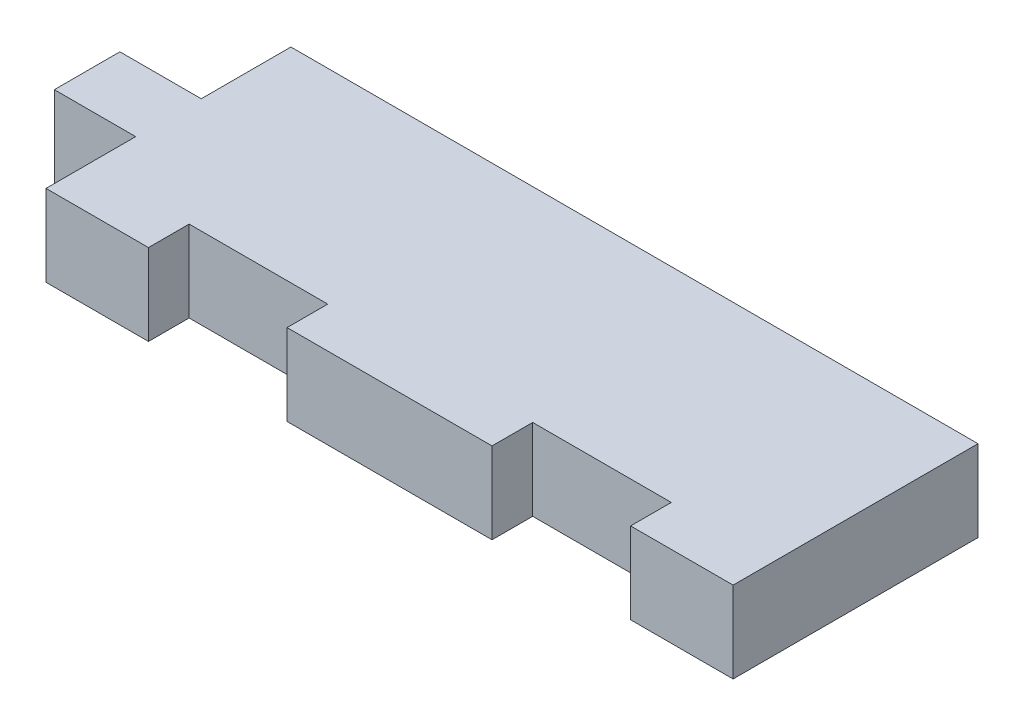
ISO-10303-21;
HEADER;
FILE_DESCRIPTION(('STEP AP214'),'2;1');
FILE_NAME('part.step','',(''),(''),'','','');
FILE_SCHEMA(('AUTOMOTIVE_DESIGN { 1 0 10303 214 1 1 1 1 }'));
ENDSEC;
DATA;
#1=APPLICATION_CONTEXT('core data for automotive mechanical design processes');
#2=APPLICATION_PROTOCOL_DEFINITION('international standard','automotive_design',2000,#1);
#3=PRODUCT_CONTEXT('',#1,'mechanical');
#4=PRODUCT('Part','Part','',(#3));
#5=PRODUCT_RELATED_PRODUCT_CATEGORY('part','',(#4));
#6=PRODUCT_DEFINITION_FORMATION('','',#4);
#7=PRODUCT_DEFINITION_CONTEXT('part definition',#1,'design');
#8=PRODUCT_DEFINITION('design','',#6,#7);
#9=PRODUCT_DEFINITION_SHAPE('','',#8);
#10=(LENGTH_UNIT() NAMED_UNIT(*) SI_UNIT(.MILLI.,.METRE.));
#11=(NAMED_UNIT(*) PLANE_ANGLE_UNIT() SI_UNIT($,.RADIAN.));
#12=(NAMED_UNIT(*) SI_UNIT($,.STERADIAN.) SOLID_ANGLE_UNIT());
#13=UNCERTAINTY_MEASURE_WITH_UNIT(LENGTH_MEASURE(1.E-05),#10,'distance_accuracy_value','');
#14=(GEOMETRIC_REPRESENTATION_CONTEXT(3) GLOBAL_UNCERTAINTY_ASSIGNED_CONTEXT((#13)) GLOBAL_UNIT_ASSIGNED_CONTEXT((#10,
#11,#12)) REPRESENTATION_CONTEXT('',''));
#15=CARTESIAN_POINT('',(0.,0.,0.));
#16=DIRECTION('',(0.,0.,1.));
#17=DIRECTION('',(1.,0.,0.));
#18=AXIS2_PLACEMENT_3D('',#15,#16,#17);
#19=CARTESIAN_POINT('',(26.8205963302752,6.35,9.55999999999996));
#20=DIRECTION('',(-1.,0.,0.));
#21=DIRECTION('',(0.,0.,1.));
#22=AXIS2_PLACEMENT_3D('',#19,#20,#21);
#23=PLANE('',#22);
#24=DIRECTION('',(0.,0.,-1.));
#25=VECTOR('',#24,1.);
#26=CARTESIAN_POINT('',(26.8205963302752,0.,9.55999999999996));
#27=LINE('',#26,#25);
#28=CARTESIAN_POINT('',(26.8205963302752,0.,9.55999999999996));
#29=VERTEX_POINT('',#28);
#30=CARTESIAN_POINT('',(26.8205963302752,0.,-9.56000000000004));
#31=VERTEX_POINT('',#30);
#32=EDGE_CURVE('E192',#29,#31,#27,.T.);
#33=ORIENTED_EDGE('',*,*,#32,.T.);
#34=DIRECTION('',(0.,-1.,0.));
#35=VECTOR('',#34,1.);
#36=CARTESIAN_POINT('',(26.8205963302752,6.35,-9.56000000000004));
#37=LINE('',#36,#35);
#38=CARTESIAN_POINT('',(26.8205963302752,6.35,-9.56000000000004));
#39=VERTEX_POINT('',#38);
#40=EDGE_CURVE('E11',#39,#31,#37,.T.);
#41=ORIENTED_EDGE('',*,*,#40,.F.);
#42=DIRECTION('',(0.,0.,-1.));
#43=VECTOR('',#42,1.);
#44=CARTESIAN_POINT('',(26.8205963302752,6.35,9.55999999999996));
#45=LINE('',#44,#43);
#46=CARTESIAN_POINT('',(26.8205963302752,6.35,9.55999999999996));
#47=VERTEX_POINT('',#46);
#48=EDGE_CURVE('E238',#47,#39,#45,.T.);
#49=ORIENTED_EDGE('',*,*,#48,.F.);
#50=DIRECTION('',(0.,-1.,0.));
#51=VECTOR('',#50,1.);
#52=CARTESIAN_POINT('',(26.8205963302752,6.35,9.55999999999996));
#53=LINE('',#52,#51);
#54=EDGE_CURVE('E188',#47,#29,#53,.T.);
#55=ORIENTED_EDGE('',*,*,#54,.T.);
#56=EDGE_LOOP('',(#33,#41,#49,#55));
#57=FACE_BOUND('',#56,.T.);
#58=ADVANCED_FACE('F43',(#57),#23,.F.);
#59=CARTESIAN_POINT('',(-26.8205963302752,6.35,-9.56));
#60=DIRECTION('',(0.,0.,1.));
#61=DIRECTION('',(1.,0.,0.));
#62=AXIS2_PLACEMENT_3D('',#59,#60,#61);
#63=PLANE('',#62);
#64=DIRECTION('',(-1.,0.,0.));
#65=VECTOR('',#64,1.);
#66=CARTESIAN_POINT('',(-26.8205963302752,0.,-9.56));
#67=LINE('',#66,#65);
#68=CARTESIAN_POINT('',(-26.8205963302752,0.,-9.56));
#69=VERTEX_POINT('',#68);
#70=EDGE_CURVE('E196',#31,#69,#67,.T.);
#71=ORIENTED_EDGE('',*,*,#70,.T.);
#72=DIRECTION('',(0.,-1.,0.));
#73=VECTOR('',#72,1.);
#74=CARTESIAN_POINT('',(-26.8205963302752,6.35,-9.56));
#75=LINE('',#74,#73);
#76=CARTESIAN_POINT('',(-26.8205963302752,6.35,-9.56));
#77=VERTEX_POINT('',#76);
#78=EDGE_CURVE('E52',#77,#69,#75,.T.);
#79=ORIENTED_EDGE('',*,*,#78,.F.);
#80=DIRECTION('',(-1.,0.,0.));
#81=VECTOR('',#80,1.);
#82=CARTESIAN_POINT('',(-26.8205963302752,6.35,-9.56));
#83=LINE('',#82,#81);
#84=EDGE_CURVE('E127',#39,#77,#83,.T.);
#85=ORIENTED_EDGE('',*,*,#84,.F.);
#86=ORIENTED_EDGE('',*,*,#40,.T.);
#87=EDGE_LOOP('',(#71,#79,#85,#86));
#88=FACE_BOUND('',#87,.T.);
#89=ADVANCED_FACE('F360',(#88),#63,.F.);
#90=CARTESIAN_POINT('',(-26.8205963302752,6.35,-2.56));
#91=DIRECTION('',(1.,0.,0.));
#92=DIRECTION('',(0.,0.,-1.));
#93=AXIS2_PLACEMENT_3D('',#90,#91,#92);
#94=PLANE('',#93);
#95=DIRECTION('',(0.,0.,1.));
#96=VECTOR('',#95,1.);
#97=CARTESIAN_POINT('',(-26.8205963302752,0.,-2.56));
#98=LINE('',#97,#96);
#99=CARTESIAN_POINT('',(-26.8205963302752,0.,-2.56));
#100=VERTEX_POINT('',#99);
#101=EDGE_CURVE('E199',#69,#100,#98,.T.);
#102=ORIENTED_EDGE('',*,*,#101,.T.);
#103=DIRECTION('',(0.,-1.,0.));
#104=VECTOR('',#103,1.);
#105=CARTESIAN_POINT('',(-26.8205963302752,6.35,-2.56));
#106=LINE('',#105,#104);
#107=CARTESIAN_POINT('',(-26.8205963302752,6.35,-2.56));
#108=VERTEX_POINT('',#107);
#109=EDGE_CURVE('E281',#108,#100,#106,.T.);
#110=ORIENTED_EDGE('',*,*,#109,.F.);
#111=DIRECTION('',(0.,0.,1.));
#112=VECTOR('',#111,1.);
#113=CARTESIAN_POINT('',(-26.8205963302752,6.35,-2.56));
#114=LINE('',#113,#112);
#115=EDGE_CURVE('E291',#77,#108,#114,.T.);
#116=ORIENTED_EDGE('',*,*,#115,.F.);
#117=ORIENTED_EDGE('',*,*,#78,.T.);
#118=EDGE_LOOP('',(#102,#110,#116,#117));
#119=FACE_BOUND('',#118,.T.);
#120=ADVANCED_FACE('F289',(#119),#94,.F.);
#121=CARTESIAN_POINT('',(-33.1705963302752,6.35,-2.56));
#122=DIRECTION('',(0.,0.,1.));
#123=DIRECTION('',(1.,0.,0.));
#124=AXIS2_PLACEMENT_3D('',#121,#122,#123);
#125=PLANE('',#124);
#126=DIRECTION('',(-1.,0.,0.));
#127=VECTOR('',#126,1.);
#128=CARTESIAN_POINT('',(-33.1705963302752,0.,-2.56));
#129=LINE('',#128,#127);
#130=CARTESIAN_POINT('',(-33.1705963302752,0.,-2.56));
#131=VERTEX_POINT('',#130);
#132=EDGE_CURVE('E202',#100,#131,#129,.T.);
#133=ORIENTED_EDGE('',*,*,#132,.T.);
#134=DIRECTION('',(0.,-1.,0.));
#135=VECTOR('',#134,1.);
#136=CARTESIAN_POINT('',(-33.1705963302752,6.35,-2.56));
#137=LINE('',#136,#135);
#138=CARTESIAN_POINT('',(-33.1705963302752,6.35,-2.56));
#139=VERTEX_POINT('',#138);
#140=EDGE_CURVE('E277',#139,#131,#137,.T.);
#141=ORIENTED_EDGE('',*,*,#140,.F.);
#142=DIRECTION('',(-1.,0.,0.));
#143=VECTOR('',#142,1.);
#144=CARTESIAN_POINT('',(-33.1705963302752,6.35,-2.56));
#145=LINE('',#144,#143);
#146=EDGE_CURVE('E310',#108,#139,#145,.T.);
#147=ORIENTED_EDGE('',*,*,#146,.F.);
#148=ORIENTED_EDGE('',*,*,#109,.T.);
#149=EDGE_LOOP('',(#133,#141,#147,#148));
#150=FACE_BOUND('',#149,.T.);
#151=ADVANCED_FACE('F300',(#150),#125,.F.);
#152=CARTESIAN_POINT('',(-33.1705963302752,6.35,-2.56));
#153=DIRECTION('',(1.,0.,0.));
#154=DIRECTION('',(0.,0.,-1.));
#155=AXIS2_PLACEMENT_3D('',#152,#153,#154);
#156=PLANE('',#155);
#157=DIRECTION('',(0.,0.,1.));
#158=VECTOR('',#157,1.);
#159=CARTESIAN_POINT('',(-33.1705963302752,0.,-2.56));
#160=LINE('',#159,#158);
#161=CARTESIAN_POINT('',(-33.1705963302752,0.,2.56));
#162=VERTEX_POINT('',#161);
#163=EDGE_CURVE('E205',#131,#162,#160,.T.);
#164=ORIENTED_EDGE('',*,*,#163,.T.);
#165=DIRECTION('',(0.,-1.,0.));
#166=VECTOR('',#165,1.);
#167=CARTESIAN_POINT('',(-33.1705963302752,6.35,2.56));
#168=LINE('',#167,#166);
#169=CARTESIAN_POINT('',(-33.1705963302752,6.35,2.56));
#170=VERTEX_POINT('',#169);
#171=EDGE_CURVE('E273',#170,#162,#168,.T.);
#172=ORIENTED_EDGE('',*,*,#171,.F.);
#173=DIRECTION('',(0.,0.,1.));
#174=VECTOR('',#173,1.);
#175=CARTESIAN_POINT('',(-33.1705963302752,6.35,-2.56));
#176=LINE('',#175,#174);
#177=EDGE_CURVE('E306',#139,#170,#176,.T.);
#178=ORIENTED_EDGE('',*,*,#177,.F.);
#179=ORIENTED_EDGE('',*,*,#140,.T.);
#180=EDGE_LOOP('',(#164,#172,#178,#179));
#181=FACE_BOUND('',#180,.T.);
#182=ADVANCED_FACE('F304',(#181),#156,.F.);
#183=CARTESIAN_POINT('',(-33.1705963302752,6.35,2.56));
#184=DIRECTION('',(0.,0.,-1.));
#185=DIRECTION('',(-1.,0.,0.));
#186=AXIS2_PLACEMENT_3D('',#183,#184,#185);
#187=PLANE('',#186);
#188=DIRECTION('',(1.,0.,0.));
#189=VECTOR('',#188,1.);
#190=CARTESIAN_POINT('',(-33.1705963302752,0.,2.56));
#191=LINE('',#190,#189);
#192=CARTESIAN_POINT('',(-26.8205963302752,0.,2.56));
#193=VERTEX_POINT('',#192);
#194=EDGE_CURVE('E208',#162,#193,#191,.T.);
#195=ORIENTED_EDGE('',*,*,#194,.T.);
#196=DIRECTION('',(0.,-1.,0.));
#197=VECTOR('',#196,1.);
#198=CARTESIAN_POINT('',(-26.8205963302752,6.35,2.56));
#199=LINE('',#198,#197);
#200=CARTESIAN_POINT('',(-26.8205963302752,6.35,2.56));
#201=VERTEX_POINT('',#200);
#202=EDGE_CURVE('E269',#201,#193,#199,.T.);
#203=ORIENTED_EDGE('',*,*,#202,.F.);
#204=DIRECTION('',(1.,0.,0.));
#205=VECTOR('',#204,1.);
#206=CARTESIAN_POINT('',(-33.1705963302752,6.35,2.56));
#207=LINE('',#206,#205);
#208=EDGE_CURVE('E309',#170,#201,#207,.T.);
#209=ORIENTED_EDGE('',*,*,#208,.F.);
#210=ORIENTED_EDGE('',*,*,#171,.T.);
#211=EDGE_LOOP('',(#195,#203,#209,#210));
#212=FACE_BOUND('',#211,.T.);
#213=ADVANCED_FACE('F373',(#212),#187,.F.);
#214=CARTESIAN_POINT('',(-26.8205963302752,6.35,2.56));
#215=DIRECTION('',(1.,0.,0.));
#216=DIRECTION('',(0.,0.,-1.));
#217=AXIS2_PLACEMENT_3D('',#214,#215,#216);
#218=PLANE('',#217);
#219=DIRECTION('',(0.,0.,1.));
#220=VECTOR('',#219,1.);
#221=CARTESIAN_POINT('',(-26.8205963302752,0.,2.56));
#222=LINE('',#221,#220);
#223=CARTESIAN_POINT('',(-26.8205963302752,0.,9.56));
#224=VERTEX_POINT('',#223);
#225=EDGE_CURVE('E211',#193,#224,#222,.T.);
#226=ORIENTED_EDGE('',*,*,#225,.T.);
#227=DIRECTION('',(0.,-1.,0.));
#228=VECTOR('',#227,1.);
#229=CARTESIAN_POINT('',(-26.8205963302752,6.35,9.56));
#230=LINE('',#229,#228);
#231=CARTESIAN_POINT('',(-26.8205963302752,6.35,9.56));
#232=VERTEX_POINT('',#231);
#233=EDGE_CURVE('E265',#232,#224,#230,.T.);
#234=ORIENTED_EDGE('',*,*,#233,.F.);
#235=DIRECTION('',(0.,0.,1.));
#236=VECTOR('',#235,1.);
#237=CARTESIAN_POINT('',(-26.8205963302752,6.35,2.56));
#238=LINE('',#237,#236);
#239=EDGE_CURVE('E314',#201,#232,#238,.T.);
#240=ORIENTED_EDGE('',*,*,#239,.F.);
#241=ORIENTED_EDGE('',*,*,#202,.T.);
#242=EDGE_LOOP('',(#226,#234,#240,#241));
#243=FACE_BOUND('',#242,.T.);
#244=ADVANCED_FACE('F376',(#243),#218,.F.);
#245=CARTESIAN_POINT('',(-26.8205963302752,6.35,9.56));
#246=DIRECTION('',(0.,0.,-1.));
#247=DIRECTION('',(-1.,0.,0.));
#248=AXIS2_PLACEMENT_3D('',#245,#246,#247);
#249=PLANE('',#248);
#250=DIRECTION('',(1.,0.,0.));
#251=VECTOR('',#250,1.);
#252=CARTESIAN_POINT('',(-26.8205963302752,0.,9.56));
#253=LINE('',#252,#251);
#254=CARTESIAN_POINT('',(-18.8205963302752,0.,9.56000000000003));
#255=VERTEX_POINT('',#254);
#256=EDGE_CURVE('E214',#224,#255,#253,.T.);
#257=ORIENTED_EDGE('',*,*,#256,.T.);
#258=DIRECTION('',(0.,-1.,0.));
#259=VECTOR('',#258,1.);
#260=CARTESIAN_POINT('',(-18.8205963302752,6.35,9.56000000000003));
#261=LINE('',#260,#259);
#262=CARTESIAN_POINT('',(-18.8205963302752,6.35,9.56000000000003));
#263=VERTEX_POINT('',#262);
#264=EDGE_CURVE('E261',#263,#255,#261,.T.);
#265=ORIENTED_EDGE('',*,*,#264,.F.);
#266=DIRECTION('',(1.,0.,0.));
#267=VECTOR('',#266,1.);
#268=CARTESIAN_POINT('',(-26.8205963302752,6.35,9.56));
#269=LINE('',#268,#267);
#270=EDGE_CURVE('E321',#232,#263,#269,.T.);
#271=ORIENTED_EDGE('',*,*,#270,.F.);
#272=ORIENTED_EDGE('',*,*,#233,.T.);
#273=EDGE_LOOP('',(#257,#265,#271,#272));
#274=FACE_BOUND('',#273,.T.);
#275=ADVANCED_FACE('F380',(#274),#249,.F.);
#276=CARTESIAN_POINT('',(-18.8205963302752,6.35,6.38500000000003));
#277=DIRECTION('',(-1.,0.,0.));
#278=DIRECTION('',(0.,0.,1.));
#279=AXIS2_PLACEMENT_3D('',#276,#277,#278);
#280=PLANE('',#279);
#281=DIRECTION('',(0.,0.,-1.));
#282=VECTOR('',#281,1.);
#283=CARTESIAN_POINT('',(-18.8205963302752,0.,6.38500000000003));
#284=LINE('',#283,#282);
#285=CARTESIAN_POINT('',(-18.8205963302752,0.,6.38500000000003));
#286=VERTEX_POINT('',#285);
#287=EDGE_CURVE('E217',#255,#286,#284,.T.);
#288=ORIENTED_EDGE('',*,*,#287,.T.);
#289=DIRECTION('',(0.,-1.,0.));
#290=VECTOR('',#289,1.);
#291=CARTESIAN_POINT('',(-18.8205963302752,6.35,6.38500000000003));
#292=LINE('',#291,#290);
#293=CARTESIAN_POINT('',(-18.8205963302752,6.35,6.38500000000003));
#294=VERTEX_POINT('',#293);
#295=EDGE_CURVE('E257',#294,#286,#292,.T.);
#296=ORIENTED_EDGE('',*,*,#295,.F.);
#297=DIRECTION('',(0.,0.,-1.));
#298=VECTOR('',#297,1.);
#299=CARTESIAN_POINT('',(-18.8205963302752,6.35,6.38500000000003));
#300=LINE('',#299,#298);
#301=EDGE_CURVE('E324',#263,#294,#300,.T.);
#302=ORIENTED_EDGE('',*,*,#301,.F.);
#303=ORIENTED_EDGE('',*,*,#264,.T.);
#304=EDGE_LOOP('',(#288,#296,#302,#303));
#305=FACE_BOUND('',#304,.T.);
#306=ADVANCED_FACE('F384',(#305),#280,.F.);
#307=CARTESIAN_POINT('',(-7.99999999999999,6.35,6.38500000000001));
#308=DIRECTION('',(0.,0.,-1.));
#309=DIRECTION('',(-1.,0.,0.));
#310=AXIS2_PLACEMENT_3D('',#307,#308,#309);
#311=PLANE('',#310);
#312=DIRECTION('',(1.,0.,0.));
#313=VECTOR('',#312,1.);
#314=CARTESIAN_POINT('',(-7.99999999999999,0.,6.38500000000001));
#315=LINE('',#314,#313);
#316=CARTESIAN_POINT('',(-7.99999999999999,0.,6.38500000000001));
#317=VERTEX_POINT('',#316);
#318=EDGE_CURVE('E220',#286,#317,#315,.T.);
#319=ORIENTED_EDGE('',*,*,#318,.T.);
#320=DIRECTION('',(0.,-1.,0.));
#321=VECTOR('',#320,1.);
#322=CARTESIAN_POINT('',(-7.99999999999999,6.35,6.38500000000001));
#323=LINE('',#322,#321);
#324=CARTESIAN_POINT('',(-7.99999999999999,6.35,6.38500000000001));
#325=VERTEX_POINT('',#324);
#326=EDGE_CURVE('E253',#325,#317,#323,.T.);
#327=ORIENTED_EDGE('',*,*,#326,.F.);
#328=DIRECTION('',(1.,0.,0.));
#329=VECTOR('',#328,1.);
#330=CARTESIAN_POINT('',(-7.99999999999999,6.35,6.38500000000001));
#331=LINE('',#330,#329);
#332=EDGE_CURVE('E327',#294,#325,#331,.T.);
#333=ORIENTED_EDGE('',*,*,#332,.F.);
#334=ORIENTED_EDGE('',*,*,#295,.T.);
#335=EDGE_LOOP('',(#319,#327,#333,#334));
#336=FACE_BOUND('',#335,.T.);
#337=ADVANCED_FACE('F388',(#336),#311,.F.);
#338=CARTESIAN_POINT('',(-7.99999999999999,6.35,6.38500000000001));
#339=DIRECTION('',(1.,0.,0.));
#340=DIRECTION('',(0.,0.,-1.));
#341=AXIS2_PLACEMENT_3D('',#338,#339,#340);
#342=PLANE('',#341);
#343=DIRECTION('',(0.,0.,1.));
#344=VECTOR('',#343,1.);
#345=CARTESIAN_POINT('',(-7.99999999999999,0.,6.38500000000001));
#346=LINE('',#345,#344);
#347=CARTESIAN_POINT('',(-7.99999999999999,0.,9.56000000000001));
#348=VERTEX_POINT('',#347);
#349=EDGE_CURVE('E223',#317,#348,#346,.T.);
#350=ORIENTED_EDGE('',*,*,#349,.T.);
#351=DIRECTION('',(0.,-1.,0.));
#352=VECTOR('',#351,1.);
#353=CARTESIAN_POINT('',(-7.99999999999999,6.35,9.56000000000001));
#354=LINE('',#353,#352);
#355=CARTESIAN_POINT('',(-7.99999999999999,6.35,9.56000000000001));
#356=VERTEX_POINT('',#355);
#357=EDGE_CURVE('E249',#356,#348,#354,.T.);
#358=ORIENTED_EDGE('',*,*,#357,.F.);
#359=DIRECTION('',(0.,0.,1.));
#360=VECTOR('',#359,1.);
#361=CARTESIAN_POINT('',(-7.99999999999999,6.35,6.38500000000001));
#362=LINE('',#361,#360);
#363=EDGE_CURVE('E330',#325,#356,#362,.T.);
#364=ORIENTED_EDGE('',*,*,#363,.F.);
#365=ORIENTED_EDGE('',*,*,#326,.T.);
#366=EDGE_LOOP('',(#350,#358,#364,#365));
#367=FACE_BOUND('',#366,.T.);
#368=ADVANCED_FACE('F392',(#367),#342,.F.);
#369=CARTESIAN_POINT('',(-7.99999999999999,6.35,9.56000000000001));
#370=DIRECTION('',(0.,0.,-1.));
#371=DIRECTION('',(-1.,0.,0.));
#372=AXIS2_PLACEMENT_3D('',#369,#370,#371);
#373=PLANE('',#372);
#374=DIRECTION('',(1.,0.,0.));
#375=VECTOR('',#374,1.);
#376=CARTESIAN_POINT('',(-7.99999999999999,0.,9.56000000000001));
#377=LINE('',#376,#375);
#378=CARTESIAN_POINT('',(8.,0.,9.56));
#379=VERTEX_POINT('',#378);
#380=EDGE_CURVE('E226',#348,#379,#377,.T.);
#381=ORIENTED_EDGE('',*,*,#380,.T.);
#382=DIRECTION('',(0.,-1.,0.));
#383=VECTOR('',#382,1.);
#384=CARTESIAN_POINT('',(8.,6.35,9.56));
#385=LINE('',#384,#383);
#386=CARTESIAN_POINT('',(8.,6.35,9.56));
#387=VERTEX_POINT('',#386);
#388=EDGE_CURVE('E245',#387,#379,#385,.T.);
#389=ORIENTED_EDGE('',*,*,#388,.F.);
#390=DIRECTION('',(1.,0.,0.));
#391=VECTOR('',#390,1.);
#392=CARTESIAN_POINT('',(-7.99999999999999,6.35,9.56000000000001));
#393=LINE('',#392,#391);
#394=EDGE_CURVE('E333',#356,#387,#393,.T.);
#395=ORIENTED_EDGE('',*,*,#394,.F.);
#396=ORIENTED_EDGE('',*,*,#357,.T.);
#397=EDGE_LOOP('',(#381,#389,#395,#396));
#398=FACE_BOUND('',#397,.T.);
#399=ADVANCED_FACE('F341',(#398),#373,.F.);
#400=CARTESIAN_POINT('',(8.,6.35,9.56));
#401=DIRECTION('',(-1.,0.,0.));
#402=DIRECTION('',(0.,0.,1.));
#403=AXIS2_PLACEMENT_3D('',#400,#401,#402);
#404=PLANE('',#403);
#405=DIRECTION('',(0.,0.,-1.));
#406=VECTOR('',#405,1.);
#407=CARTESIAN_POINT('',(8.,0.,9.56));
#408=LINE('',#407,#406);
#409=CARTESIAN_POINT('',(8.,0.,6.385));
#410=VERTEX_POINT('',#409);
#411=EDGE_CURVE('E229',#379,#410,#408,.T.);
#412=ORIENTED_EDGE('',*,*,#411,.T.);
#413=DIRECTION('',(0.,-1.,0.));
#414=VECTOR('',#413,1.);
#415=CARTESIAN_POINT('',(8.,6.35,6.385));
#416=LINE('',#415,#414);
#417=CARTESIAN_POINT('',(8.,6.35,6.385));
#418=VERTEX_POINT('',#417);
#419=EDGE_CURVE('E181',#418,#410,#416,.T.);
#420=ORIENTED_EDGE('',*,*,#419,.F.);
#421=DIRECTION('',(0.,0.,-1.));
#422=VECTOR('',#421,1.);
#423=CARTESIAN_POINT('',(8.,6.35,9.56));
#424=LINE('',#423,#422);
#425=EDGE_CURVE('E170',#387,#418,#424,.T.);
#426=ORIENTED_EDGE('',*,*,#425,.F.);
#427=ORIENTED_EDGE('',*,*,#388,.T.);
#428=EDGE_LOOP('',(#412,#420,#426,#427));
#429=FACE_BOUND('',#428,.T.);
#430=ADVANCED_FACE('F345',(#429),#404,.F.);
#431=CARTESIAN_POINT('',(8.,6.35,6.385));
#432=DIRECTION('',(0.,0.,-1.));
#433=DIRECTION('',(-1.,0.,0.));
#434=AXIS2_PLACEMENT_3D('',#431,#432,#433);
#435=PLANE('',#434);
#436=DIRECTION('',(1.,0.,0.));
#437=VECTOR('',#436,1.);
#438=CARTESIAN_POINT('',(8.,0.,6.385));
#439=LINE('',#438,#437);
#440=CARTESIAN_POINT('',(18.8205963302752,0.,6.385));
#441=VERTEX_POINT('',#440);
#442=EDGE_CURVE('E179',#410,#441,#439,.T.);
#443=ORIENTED_EDGE('',*,*,#442,.T.);
#444=DIRECTION('',(0.,-1.,0.));
#445=VECTOR('',#444,1.);
#446=CARTESIAN_POINT('',(18.8205963302752,6.35,6.385));
#447=LINE('',#446,#445);
#448=CARTESIAN_POINT('',(18.8205963302752,6.35,6.385));
#449=VERTEX_POINT('',#448);
#450=EDGE_CURVE('E176',#449,#441,#447,.T.);
#451=ORIENTED_EDGE('',*,*,#450,.F.);
#452=DIRECTION('',(1.,0.,0.));
#453=VECTOR('',#452,1.);
#454=CARTESIAN_POINT('',(8.,6.35,6.385));
#455=LINE('',#454,#453);
#456=EDGE_CURVE('E164',#418,#449,#455,.T.);
#457=ORIENTED_EDGE('',*,*,#456,.F.);
#458=ORIENTED_EDGE('',*,*,#419,.T.);
#459=EDGE_LOOP('',(#443,#451,#457,#458));
#460=FACE_BOUND('',#459,.T.);
#461=ADVANCED_FACE('F177',(#460),#435,.F.);
#462=CARTESIAN_POINT('',(18.8205963302752,6.35,6.385));
#463=DIRECTION('',(1.,0.,0.));
#464=DIRECTION('',(0.,0.,-1.));
#465=AXIS2_PLACEMENT_3D('',#462,#463,#464);
#466=PLANE('',#465);
#467=DIRECTION('',(0.,0.,1.));
#468=VECTOR('',#467,1.);
#469=CARTESIAN_POINT('',(18.8205963302752,0.,6.385));
#470=LINE('',#469,#468);
#471=CARTESIAN_POINT('',(18.8205963302752,0.,9.56));
#472=VERTEX_POINT('',#471);
#473=EDGE_CURVE('E113',#441,#472,#470,.T.);
#474=ORIENTED_EDGE('',*,*,#473,.T.);
#475=DIRECTION('',(0.,-1.,0.));
#476=VECTOR('',#475,1.);
#477=CARTESIAN_POINT('',(18.8205963302752,6.35,9.56));
#478=LINE('',#477,#476);
#479=CARTESIAN_POINT('',(18.8205963302752,6.35,9.56));
#480=VERTEX_POINT('',#479);
#481=EDGE_CURVE('E182',#480,#472,#478,.T.);
#482=ORIENTED_EDGE('',*,*,#481,.F.);
#483=DIRECTION('',(0.,0.,1.));
#484=VECTOR('',#483,1.);
#485=CARTESIAN_POINT('',(18.8205963302752,6.35,6.385));
#486=LINE('',#485,#484);
#487=EDGE_CURVE('E168',#449,#480,#486,.T.);
#488=ORIENTED_EDGE('',*,*,#487,.F.);
#489=ORIENTED_EDGE('',*,*,#450,.T.);
#490=EDGE_LOOP('',(#474,#482,#488,#489));
#491=FACE_BOUND('',#490,.T.);
#492=ADVANCED_FACE('F184',(#491),#466,.F.);
#493=CARTESIAN_POINT('',(26.8205963302752,6.35,9.55999999999996));
#494=DIRECTION('',(0.,0.,-1.));
#495=DIRECTION('',(-1.,0.,0.));
#496=AXIS2_PLACEMENT_3D('',#493,#494,#495);
#497=PLANE('',#496);
#498=DIRECTION('',(1.,0.,0.));
#499=VECTOR('',#498,1.);
#500=CARTESIAN_POINT('',(26.8205963302752,0.,9.55999999999996));
#501=LINE('',#500,#499);
#502=EDGE_CURVE('E119',#472,#29,#501,.T.);
#503=ORIENTED_EDGE('',*,*,#502,.T.);
#504=ORIENTED_EDGE('',*,*,#54,.F.);
#505=DIRECTION('',(1.,0.,0.));
#506=VECTOR('',#505,1.);
#507=CARTESIAN_POINT('',(26.8205963302752,6.35,9.55999999999996));
#508=LINE('',#507,#506);
#509=EDGE_CURVE('E60',#480,#47,#508,.T.);
#510=ORIENTED_EDGE('',*,*,#509,.F.);
#511=ORIENTED_EDGE('',*,*,#481,.T.);
#512=EDGE_LOOP('',(#503,#504,#510,#511));
#513=FACE_BOUND('',#512,.T.);
#514=ADVANCED_FACE('F349',(#513),#497,.F.);
#515=CARTESIAN_POINT('',(0.,6.35,0.));
#516=DIRECTION('',(0.,-1.,0.));
#517=DIRECTION('',(0.,0.,-1.));
#518=AXIS2_PLACEMENT_3D('',#515,#516,#517);
#519=PLANE('',#518);
#520=ORIENTED_EDGE('',*,*,#48,.T.);
#521=ORIENTED_EDGE('',*,*,#84,.T.);
#522=ORIENTED_EDGE('',*,*,#115,.T.);
#523=ORIENTED_EDGE('',*,*,#146,.T.);
#524=ORIENTED_EDGE('',*,*,#177,.T.);
#525=ORIENTED_EDGE('',*,*,#208,.T.);
#526=ORIENTED_EDGE('',*,*,#239,.T.);
#527=ORIENTED_EDGE('',*,*,#270,.T.);
#528=ORIENTED_EDGE('',*,*,#301,.T.);
#529=ORIENTED_EDGE('',*,*,#332,.T.);
#530=ORIENTED_EDGE('',*,*,#363,.T.);
#531=ORIENTED_EDGE('',*,*,#394,.T.);
#532=ORIENTED_EDGE('',*,*,#425,.T.);
#533=ORIENTED_EDGE('',*,*,#456,.T.);
#534=ORIENTED_EDGE('',*,*,#487,.T.);
#535=ORIENTED_EDGE('',*,*,#509,.T.);
#536=EDGE_LOOP('',(#520,#521,#522,#523,#524,#525,#526,#527,#528,#529,#530,#531,#532,#533,#534,#535));
#537=FACE_BOUND('',#536,.T.);
#538=ADVANCED_FACE('F166',(#537),#519,.F.);
#539=CARTESIAN_POINT('',(0.,0.,0.));
#540=DIRECTION('',(0.,-1.,0.));
#541=DIRECTION('',(0.,0.,-1.));
#542=AXIS2_PLACEMENT_3D('',#539,#540,#541);
#543=PLANE('',#542);
#544=ORIENTED_EDGE('',*,*,#32,.F.);
#545=ORIENTED_EDGE('',*,*,#502,.F.);
#546=ORIENTED_EDGE('',*,*,#473,.F.);
#547=ORIENTED_EDGE('',*,*,#442,.F.);
#548=ORIENTED_EDGE('',*,*,#411,.F.);
#549=ORIENTED_EDGE('',*,*,#380,.F.);
#550=ORIENTED_EDGE('',*,*,#349,.F.);
#551=ORIENTED_EDGE('',*,*,#318,.F.);
#552=ORIENTED_EDGE('',*,*,#287,.F.);
#553=ORIENTED_EDGE('',*,*,#256,.F.);
#554=ORIENTED_EDGE('',*,*,#225,.F.);
#555=ORIENTED_EDGE('',*,*,#194,.F.);
#556=ORIENTED_EDGE('',*,*,#163,.F.);
#557=ORIENTED_EDGE('',*,*,#132,.F.);
#558=ORIENTED_EDGE('',*,*,#101,.F.);
#559=ORIENTED_EDGE('',*,*,#70,.F.);
#560=EDGE_LOOP('',(#544,#545,#546,#547,#548,#549,#550,#551,#552,#553,#554,#555,#556,#557,#558,#559));
#561=FACE_BOUND('',#560,.T.);
#562=ADVANCED_FACE('F295',(#561),#543,.T.);
#563=CLOSED_SHELL('',(#58,#89,#120,#151,#182,#213,#244,#275,#306,#337,#368,#399,#430,#461,#492,
#514,#538,#562));
#564=MANIFOLD_SOLID_BREP('B2',#563);
#565=ADVANCED_BREP_SHAPE_REPRESENTATION('',(#18,#564),#14);
#566=SHAPE_DEFINITION_REPRESENTATION(#9,#565);
ENDSEC;
END-ISO-10303-21;
